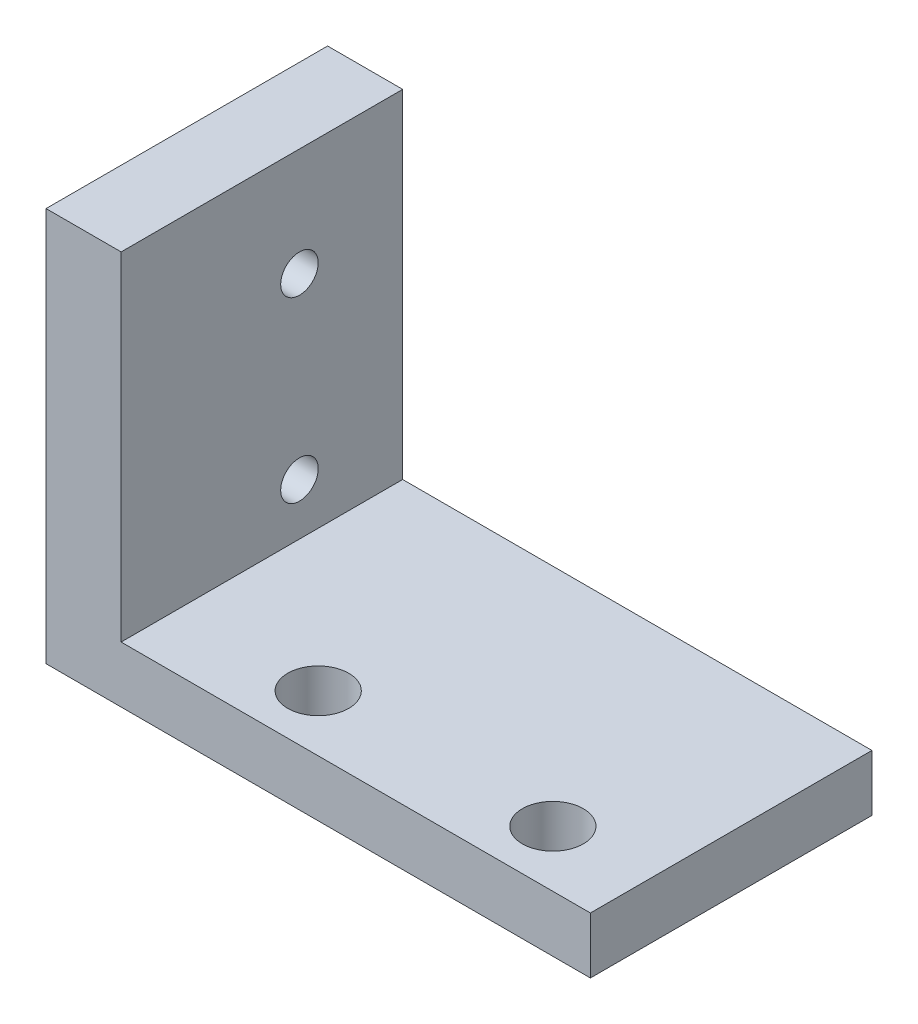
ISO-10303-21;
HEADER;
FILE_DESCRIPTION(('STEP AP214'),'2;1');
FILE_NAME('part.step','',(''),(''),'','','');
FILE_SCHEMA(('AUTOMOTIVE_DESIGN { 1 0 10303 214 1 1 1 1 }'));
ENDSEC;
DATA;
#1=APPLICATION_CONTEXT('core data for automotive mechanical design processes');
#2=APPLICATION_PROTOCOL_DEFINITION('international standard','automotive_design',2000,#1);
#3=PRODUCT_CONTEXT('',#1,'mechanical');
#4=PRODUCT('Part','Part','',(#3));
#5=PRODUCT_RELATED_PRODUCT_CATEGORY('part','',(#4));
#6=PRODUCT_DEFINITION_FORMATION('','',#4);
#7=PRODUCT_DEFINITION_CONTEXT('part definition',#1,'design');
#8=PRODUCT_DEFINITION('design','',#6,#7);
#9=PRODUCT_DEFINITION_SHAPE('','',#8);
#10=(LENGTH_UNIT() NAMED_UNIT(*) SI_UNIT(.MILLI.,.METRE.));
#11=(NAMED_UNIT(*) PLANE_ANGLE_UNIT() SI_UNIT($,.RADIAN.));
#12=(NAMED_UNIT(*) SI_UNIT($,.STERADIAN.) SOLID_ANGLE_UNIT());
#13=UNCERTAINTY_MEASURE_WITH_UNIT(LENGTH_MEASURE(1.E-05),#10,'distance_accuracy_value','');
#14=(GEOMETRIC_REPRESENTATION_CONTEXT(3) GLOBAL_UNCERTAINTY_ASSIGNED_CONTEXT((#13)) GLOBAL_UNIT_ASSIGNED_CONTEXT((#10,
#11,#12)) REPRESENTATION_CONTEXT('',''));
#15=CARTESIAN_POINT('',(0.,0.,0.));
#16=DIRECTION('',(0.,0.,1.));
#17=DIRECTION('',(1.,0.,0.));
#18=AXIS2_PLACEMENT_3D('',#15,#16,#17);
#19=CARTESIAN_POINT('',(-14.5,3.,-7.5));
#20=DIRECTION('',(1.,0.,0.));
#21=DIRECTION('',(0.,0.,-1.));
#22=AXIS2_PLACEMENT_3D('',#19,#20,#21);
#23=PLANE('',#22);
#24=CARTESIAN_POINT('',(-14.5,15.25,-2.));
#25=DIRECTION('',(-1.,0.,0.));
#26=DIRECTION('',(0.,0.,1.));
#27=AXIS2_PLACEMENT_3D('',#24,#25,#26);
#28=CIRCLE('',#27,1.);
#29=CARTESIAN_POINT('',(-14.5,15.25,-0.999999999999999));
#30=VERTEX_POINT('',#29);
#31=EDGE_CURVE('E122',#30,#30,#28,.T.);
#32=ORIENTED_EDGE('',*,*,#31,.F.);
#33=EDGE_LOOP('',(#32));
#34=FACE_BOUND('',#33,.T.);
#35=CARTESIAN_POINT('',(-14.5,5.75,-2.));
#36=DIRECTION('',(-1.,0.,0.));
#37=DIRECTION('',(0.,0.,1.));
#38=AXIS2_PLACEMENT_3D('',#35,#36,#37);
#39=CIRCLE('',#38,1.);
#40=CARTESIAN_POINT('',(-14.5,5.75,-0.999999999999999));
#41=VERTEX_POINT('',#40);
#42=EDGE_CURVE('E113',#41,#41,#39,.T.);
#43=ORIENTED_EDGE('',*,*,#42,.F.);
#44=EDGE_LOOP('',(#43));
#45=FACE_BOUND('',#44,.T.);
#46=DIRECTION('',(0.,0.,1.));
#47=VECTOR('',#46,1.);
#48=CARTESIAN_POINT('',(-14.5,0.,-7.5));
#49=LINE('',#48,#47);
#50=CARTESIAN_POINT('',(-14.5,0.,-7.5));
#51=VERTEX_POINT('',#50);
#52=CARTESIAN_POINT('',(-14.5,0.,7.5));
#53=VERTEX_POINT('',#52);
#54=EDGE_CURVE('E92',#51,#53,#49,.T.);
#55=ORIENTED_EDGE('',*,*,#54,.T.);
#56=DIRECTION('',(0.,-1.,0.));
#57=VECTOR('',#56,1.);
#58=CARTESIAN_POINT('',(-14.5,3.,7.5));
#59=LINE('',#58,#57);
#60=CARTESIAN_POINT('',(-14.5,21.,7.5));
#61=VERTEX_POINT('',#60);
#62=EDGE_CURVE('E11',#61,#53,#59,.T.);
#63=ORIENTED_EDGE('',*,*,#62,.F.);
#64=DIRECTION('',(0.,0.,1.));
#65=VECTOR('',#64,1.);
#66=CARTESIAN_POINT('',(-14.5,21.,-7.5));
#67=LINE('',#66,#65);
#68=CARTESIAN_POINT('',(-14.5,21.,-7.5));
#69=VERTEX_POINT('',#68);
#70=EDGE_CURVE('E94',#69,#61,#67,.T.);
#71=ORIENTED_EDGE('',*,*,#70,.F.);
#72=DIRECTION('',(0.,-1.,0.));
#73=VECTOR('',#72,1.);
#74=CARTESIAN_POINT('',(-14.5,3.,-7.5));
#75=LINE('',#74,#73);
#76=EDGE_CURVE('E78',#69,#51,#75,.T.);
#77=ORIENTED_EDGE('',*,*,#76,.T.);
#78=EDGE_LOOP('',(#55,#63,#71,#77));
#79=FACE_BOUND('',#78,.T.);
#80=ADVANCED_FACE('F32',(#34,#45,#79),#23,.F.);
#81=CARTESIAN_POINT('',(-14.5,3.,7.5));
#82=DIRECTION('',(0.,0.,-1.));
#83=DIRECTION('',(-1.,0.,0.));
#84=AXIS2_PLACEMENT_3D('',#81,#82,#83);
#85=PLANE('',#84);
#86=DIRECTION('',(1.,0.,0.));
#87=VECTOR('',#86,1.);
#88=CARTESIAN_POINT('',(-14.5,0.,7.5));
#89=LINE('',#88,#87);
#90=CARTESIAN_POINT('',(14.5,0.,7.5));
#91=VERTEX_POINT('',#90);
#92=EDGE_CURVE('E98',#53,#91,#89,.T.);
#93=ORIENTED_EDGE('',*,*,#92,.T.);
#94=DIRECTION('',(0.,-1.,0.));
#95=VECTOR('',#94,1.);
#96=CARTESIAN_POINT('',(14.5,3.,7.5));
#97=LINE('',#96,#95);
#98=CARTESIAN_POINT('',(14.5,3.,7.5));
#99=VERTEX_POINT('',#98);
#100=EDGE_CURVE('E40',#99,#91,#97,.T.);
#101=ORIENTED_EDGE('',*,*,#100,.F.);
#102=DIRECTION('',(1.,0.,0.));
#103=VECTOR('',#102,1.);
#104=CARTESIAN_POINT('',(-14.5,3.,7.5));
#105=LINE('',#104,#103);
#106=CARTESIAN_POINT('',(-10.5,3.,7.5));
#107=VERTEX_POINT('',#106);
#108=EDGE_CURVE('E85',#107,#99,#105,.T.);
#109=ORIENTED_EDGE('',*,*,#108,.F.);
#110=DIRECTION('',(0.,-1.,0.));
#111=VECTOR('',#110,1.);
#112=CARTESIAN_POINT('',(-10.5,21.,7.5));
#113=LINE('',#112,#111);
#114=CARTESIAN_POINT('',(-10.5,21.,7.5));
#115=VERTEX_POINT('',#114);
#116=EDGE_CURVE('E137',#115,#107,#113,.T.);
#117=ORIENTED_EDGE('',*,*,#116,.F.);
#118=DIRECTION('',(1.,0.,0.));
#119=VECTOR('',#118,1.);
#120=CARTESIAN_POINT('',(-14.5,21.,7.5));
#121=LINE('',#120,#119);
#122=EDGE_CURVE('E126',#61,#115,#121,.T.);
#123=ORIENTED_EDGE('',*,*,#122,.F.);
#124=ORIENTED_EDGE('',*,*,#62,.T.);
#125=EDGE_LOOP('',(#93,#101,#109,#117,#123,#124));
#126=FACE_BOUND('',#125,.T.);
#127=ADVANCED_FACE('F167',(#126),#85,.F.);
#128=CARTESIAN_POINT('',(14.5,3.,-7.5));
#129=DIRECTION('',(-1.,0.,0.));
#130=DIRECTION('',(0.,0.,1.));
#131=AXIS2_PLACEMENT_3D('',#128,#129,#130);
#132=PLANE('',#131);
#133=DIRECTION('',(0.,0.,-1.));
#134=VECTOR('',#133,1.);
#135=CARTESIAN_POINT('',(14.5,0.,-7.5));
#136=LINE('',#135,#134);
#137=CARTESIAN_POINT('',(14.5,0.,-7.5));
#138=VERTEX_POINT('',#137);
#139=EDGE_CURVE('E86',#91,#138,#136,.T.);
#140=ORIENTED_EDGE('',*,*,#139,.T.);
#141=DIRECTION('',(0.,-1.,0.));
#142=VECTOR('',#141,1.);
#143=CARTESIAN_POINT('',(14.5,3.,-7.5));
#144=LINE('',#143,#142);
#145=CARTESIAN_POINT('',(14.5,3.,-7.5));
#146=VERTEX_POINT('',#145);
#147=EDGE_CURVE('E81',#146,#138,#144,.T.);
#148=ORIENTED_EDGE('',*,*,#147,.F.);
#149=DIRECTION('',(0.,0.,-1.));
#150=VECTOR('',#149,1.);
#151=CARTESIAN_POINT('',(14.5,3.,-7.5));
#152=LINE('',#151,#150);
#153=EDGE_CURVE('E54',#99,#146,#152,.T.);
#154=ORIENTED_EDGE('',*,*,#153,.F.);
#155=ORIENTED_EDGE('',*,*,#100,.T.);
#156=EDGE_LOOP('',(#140,#148,#154,#155));
#157=FACE_BOUND('',#156,.T.);
#158=ADVANCED_FACE('F170',(#157),#132,.F.);
#159=CARTESIAN_POINT('',(-14.5,3.,-7.5));
#160=DIRECTION('',(0.,0.,1.));
#161=DIRECTION('',(1.,0.,0.));
#162=AXIS2_PLACEMENT_3D('',#159,#160,#161);
#163=PLANE('',#162);
#164=DIRECTION('',(-1.,0.,0.));
#165=VECTOR('',#164,1.);
#166=CARTESIAN_POINT('',(-14.5,0.,-7.5));
#167=LINE('',#166,#165);
#168=EDGE_CURVE('E74',#138,#51,#167,.T.);
#169=ORIENTED_EDGE('',*,*,#168,.T.);
#170=ORIENTED_EDGE('',*,*,#76,.F.);
#171=DIRECTION('',(-1.,0.,0.));
#172=VECTOR('',#171,1.);
#173=CARTESIAN_POINT('',(-14.5,21.,-7.5));
#174=LINE('',#173,#172);
#175=CARTESIAN_POINT('',(-10.5,21.,-7.5));
#176=VERTEX_POINT('',#175);
#177=EDGE_CURVE('E132',#176,#69,#174,.T.);
#178=ORIENTED_EDGE('',*,*,#177,.F.);
#179=DIRECTION('',(0.,-1.,0.));
#180=VECTOR('',#179,1.);
#181=CARTESIAN_POINT('',(-10.5,21.,-7.5));
#182=LINE('',#181,#180);
#183=CARTESIAN_POINT('',(-10.5,3.,-7.5));
#184=VERTEX_POINT('',#183);
#185=EDGE_CURVE('E133',#176,#184,#182,.T.);
#186=ORIENTED_EDGE('',*,*,#185,.T.);
#187=DIRECTION('',(-1.,0.,0.));
#188=VECTOR('',#187,1.);
#189=CARTESIAN_POINT('',(-14.5,3.,-7.5));
#190=LINE('',#189,#188);
#191=EDGE_CURVE('E95',#146,#184,#190,.T.);
#192=ORIENTED_EDGE('',*,*,#191,.F.);
#193=ORIENTED_EDGE('',*,*,#147,.T.);
#194=EDGE_LOOP('',(#169,#170,#178,#186,#192,#193));
#195=FACE_BOUND('',#194,.T.);
#196=ADVANCED_FACE('F76',(#195),#163,.F.);
#197=CARTESIAN_POINT('',(0.,3.,0.));
#198=DIRECTION('',(0.,1.,0.));
#199=DIRECTION('',(0.,0.,1.));
#200=AXIS2_PLACEMENT_3D('',#197,#198,#199);
#201=PLANE('',#200);
#202=DIRECTION('',(0.,0.,-1.));
#203=VECTOR('',#202,1.);
#204=CARTESIAN_POINT('',(-10.5,3.,-7.5));
#205=LINE('',#204,#203);
#206=EDGE_CURVE('E48',#107,#184,#205,.T.);
#207=ORIENTED_EDGE('',*,*,#206,.F.);
#208=ORIENTED_EDGE('',*,*,#108,.T.);
#209=ORIENTED_EDGE('',*,*,#153,.T.);
#210=ORIENTED_EDGE('',*,*,#191,.T.);
#211=EDGE_LOOP('',(#207,#208,#209,#210));
#212=FACE_BOUND('',#211,.T.);
#213=CARTESIAN_POINT('',(9.49999999999999,3.,4.5));
#214=DIRECTION('',(0.,1.,0.));
#215=DIRECTION('',(0.,0.,1.));
#216=AXIS2_PLACEMENT_3D('',#213,#214,#215);
#217=CIRCLE('',#216,1.625);
#218=CARTESIAN_POINT('',(9.49999999999999,3.,6.125));
#219=VERTEX_POINT('',#218);
#220=EDGE_CURVE('E140',#219,#219,#217,.T.);
#221=ORIENTED_EDGE('',*,*,#220,.F.);
#222=EDGE_LOOP('',(#221));
#223=FACE_BOUND('',#222,.T.);
#224=CARTESIAN_POINT('',(-3.00000000000001,3.,4.5));
#225=DIRECTION('',(0.,1.,0.));
#226=DIRECTION('',(0.,0.,1.));
#227=AXIS2_PLACEMENT_3D('',#224,#225,#226);
#228=CIRCLE('',#227,1.625);
#229=CARTESIAN_POINT('',(-3.00000000000001,3.,6.125));
#230=VERTEX_POINT('',#229);
#231=EDGE_CURVE('E103',#230,#230,#228,.T.);
#232=ORIENTED_EDGE('',*,*,#231,.F.);
#233=EDGE_LOOP('',(#232));
#234=FACE_BOUND('',#233,.T.);
#235=ADVANCED_FACE('F149',(#212,#223,#234),#201,.T.);
#236=CARTESIAN_POINT('',(0.,0.,0.));
#237=DIRECTION('',(0.,1.,0.));
#238=DIRECTION('',(0.,0.,1.));
#239=AXIS2_PLACEMENT_3D('',#236,#237,#238);
#240=PLANE('',#239);
#241=CARTESIAN_POINT('',(9.49999999999999,0.,4.5));
#242=DIRECTION('',(0.,1.,0.));
#243=DIRECTION('',(0.,0.,1.));
#244=AXIS2_PLACEMENT_3D('',#241,#242,#243);
#245=CIRCLE('',#244,1.625);
#246=CARTESIAN_POINT('',(9.49999999999999,0.,6.125));
#247=VERTEX_POINT('',#246);
#248=EDGE_CURVE('E141',#247,#247,#245,.T.);
#249=ORIENTED_EDGE('',*,*,#248,.T.);
#250=EDGE_LOOP('',(#249));
#251=FACE_BOUND('',#250,.T.);
#252=CARTESIAN_POINT('',(-3.00000000000001,0.,4.5));
#253=DIRECTION('',(0.,1.,0.));
#254=DIRECTION('',(0.,0.,1.));
#255=AXIS2_PLACEMENT_3D('',#252,#253,#254);
#256=CIRCLE('',#255,1.625);
#257=CARTESIAN_POINT('',(-3.00000000000001,0.,6.125));
#258=VERTEX_POINT('',#257);
#259=EDGE_CURVE('E99',#258,#258,#256,.T.);
#260=ORIENTED_EDGE('',*,*,#259,.T.);
#261=EDGE_LOOP('',(#260));
#262=FACE_BOUND('',#261,.T.);
#263=ORIENTED_EDGE('',*,*,#54,.F.);
#264=ORIENTED_EDGE('',*,*,#168,.F.);
#265=ORIENTED_EDGE('',*,*,#139,.F.);
#266=ORIENTED_EDGE('',*,*,#92,.F.);
#267=EDGE_LOOP('',(#263,#264,#265,#266));
#268=FACE_BOUND('',#267,.T.);
#269=ADVANCED_FACE('F97',(#251,#262,#268),#240,.F.);
#270=CARTESIAN_POINT('',(-3.00000000000001,0.,4.5));
#271=DIRECTION('',(0.,1.,0.));
#272=DIRECTION('',(0.,0.,1.));
#273=AXIS2_PLACEMENT_3D('',#270,#271,#272);
#274=CYLINDRICAL_SURFACE('',#273,1.625);
#275=ORIENTED_EDGE('',*,*,#259,.F.);
#276=EDGE_LOOP('',(#275));
#277=FACE_BOUND('',#276,.T.);
#278=ORIENTED_EDGE('',*,*,#231,.T.);
#279=EDGE_LOOP('',(#278));
#280=FACE_BOUND('',#279,.T.);
#281=ADVANCED_FACE('F201',(#277,#280),#274,.F.);
#282=CARTESIAN_POINT('',(9.49999999999999,0.,4.5));
#283=DIRECTION('',(0.,1.,0.));
#284=DIRECTION('',(0.,0.,1.));
#285=AXIS2_PLACEMENT_3D('',#282,#283,#284);
#286=CYLINDRICAL_SURFACE('',#285,1.625);
#287=ORIENTED_EDGE('',*,*,#248,.F.);
#288=EDGE_LOOP('',(#287));
#289=FACE_BOUND('',#288,.T.);
#290=ORIENTED_EDGE('',*,*,#220,.T.);
#291=EDGE_LOOP('',(#290));
#292=FACE_BOUND('',#291,.T.);
#293=ADVANCED_FACE('F194',(#289,#292),#286,.F.);
#294=CARTESIAN_POINT('',(-10.5,21.,-7.5));
#295=DIRECTION('',(-1.,0.,0.));
#296=DIRECTION('',(0.,0.,1.));
#297=AXIS2_PLACEMENT_3D('',#294,#295,#296);
#298=PLANE('',#297);
#299=CARTESIAN_POINT('',(-10.5,15.25,-2.));
#300=DIRECTION('',(-1.,0.,0.));
#301=DIRECTION('',(0.,0.,1.));
#302=AXIS2_PLACEMENT_3D('',#299,#300,#301);
#303=CIRCLE('',#302,1.);
#304=CARTESIAN_POINT('',(-10.5,15.25,-0.999999999999999));
#305=VERTEX_POINT('',#304);
#306=EDGE_CURVE('E35',#305,#305,#303,.T.);
#307=ORIENTED_EDGE('',*,*,#306,.T.);
#308=EDGE_LOOP('',(#307));
#309=FACE_BOUND('',#308,.T.);
#310=CARTESIAN_POINT('',(-10.5,5.75,-2.));
#311=DIRECTION('',(-1.,0.,0.));
#312=DIRECTION('',(0.,0.,1.));
#313=AXIS2_PLACEMENT_3D('',#310,#311,#312);
#314=CIRCLE('',#313,1.);
#315=CARTESIAN_POINT('',(-10.5,5.75,-1.));
#316=VERTEX_POINT('',#315);
#317=EDGE_CURVE('E111',#316,#316,#314,.T.);
#318=ORIENTED_EDGE('',*,*,#317,.T.);
#319=EDGE_LOOP('',(#318));
#320=FACE_BOUND('',#319,.T.);
#321=ORIENTED_EDGE('',*,*,#206,.T.);
#322=ORIENTED_EDGE('',*,*,#185,.F.);
#323=DIRECTION('',(0.,0.,-1.));
#324=VECTOR('',#323,1.);
#325=CARTESIAN_POINT('',(-10.5,21.,-7.5));
#326=LINE('',#325,#324);
#327=EDGE_CURVE('E129',#115,#176,#326,.T.);
#328=ORIENTED_EDGE('',*,*,#327,.F.);
#329=ORIENTED_EDGE('',*,*,#116,.T.);
#330=EDGE_LOOP('',(#321,#322,#328,#329));
#331=FACE_BOUND('',#330,.T.);
#332=ADVANCED_FACE('F154',(#309,#320,#331),#298,.F.);
#333=CARTESIAN_POINT('',(0.,21.,0.));
#334=DIRECTION('',(0.,1.,0.));
#335=DIRECTION('',(0.,0.,1.));
#336=AXIS2_PLACEMENT_3D('',#333,#334,#335);
#337=PLANE('',#336);
#338=ORIENTED_EDGE('',*,*,#70,.T.);
#339=ORIENTED_EDGE('',*,*,#122,.T.);
#340=ORIENTED_EDGE('',*,*,#327,.T.);
#341=ORIENTED_EDGE('',*,*,#177,.T.);
#342=EDGE_LOOP('',(#338,#339,#340,#341));
#343=FACE_BOUND('',#342,.T.);
#344=ADVANCED_FACE('F161',(#343),#337,.T.);
#345=CARTESIAN_POINT('',(-1.5,5.75,-2.));
#346=DIRECTION('',(-1.,0.,0.));
#347=DIRECTION('',(0.,0.,1.));
#348=AXIS2_PLACEMENT_3D('',#345,#346,#347);
#349=CYLINDRICAL_SURFACE('',#348,1.);
#350=ORIENTED_EDGE('',*,*,#42,.T.);
#351=EDGE_LOOP('',(#350));
#352=FACE_BOUND('',#351,.T.);
#353=ORIENTED_EDGE('',*,*,#317,.F.);
#354=EDGE_LOOP('',(#353));
#355=FACE_BOUND('',#354,.T.);
#356=ADVANCED_FACE('F189',(#352,#355),#349,.F.);
#357=CARTESIAN_POINT('',(-1.5,15.25,-2.));
#358=DIRECTION('',(-1.,0.,0.));
#359=DIRECTION('',(0.,0.,1.));
#360=AXIS2_PLACEMENT_3D('',#357,#358,#359);
#361=CYLINDRICAL_SURFACE('',#360,1.);
#362=ORIENTED_EDGE('',*,*,#31,.T.);
#363=EDGE_LOOP('',(#362));
#364=FACE_BOUND('',#363,.T.);
#365=ORIENTED_EDGE('',*,*,#306,.F.);
#366=EDGE_LOOP('',(#365));
#367=FACE_BOUND('',#366,.T.);
#368=ADVANCED_FACE('F186',(#364,#367),#361,.F.);
#369=CLOSED_SHELL('',(#80,#127,#158,#196,#235,#269,#281,#293,#332,#344,#356,#368));
#370=MANIFOLD_SOLID_BREP('B2',#369);
#371=ADVANCED_BREP_SHAPE_REPRESENTATION('',(#18,#370),#14);
#372=SHAPE_DEFINITION_REPRESENTATION(#9,#371);
ENDSEC;
END-ISO-10303-21;
